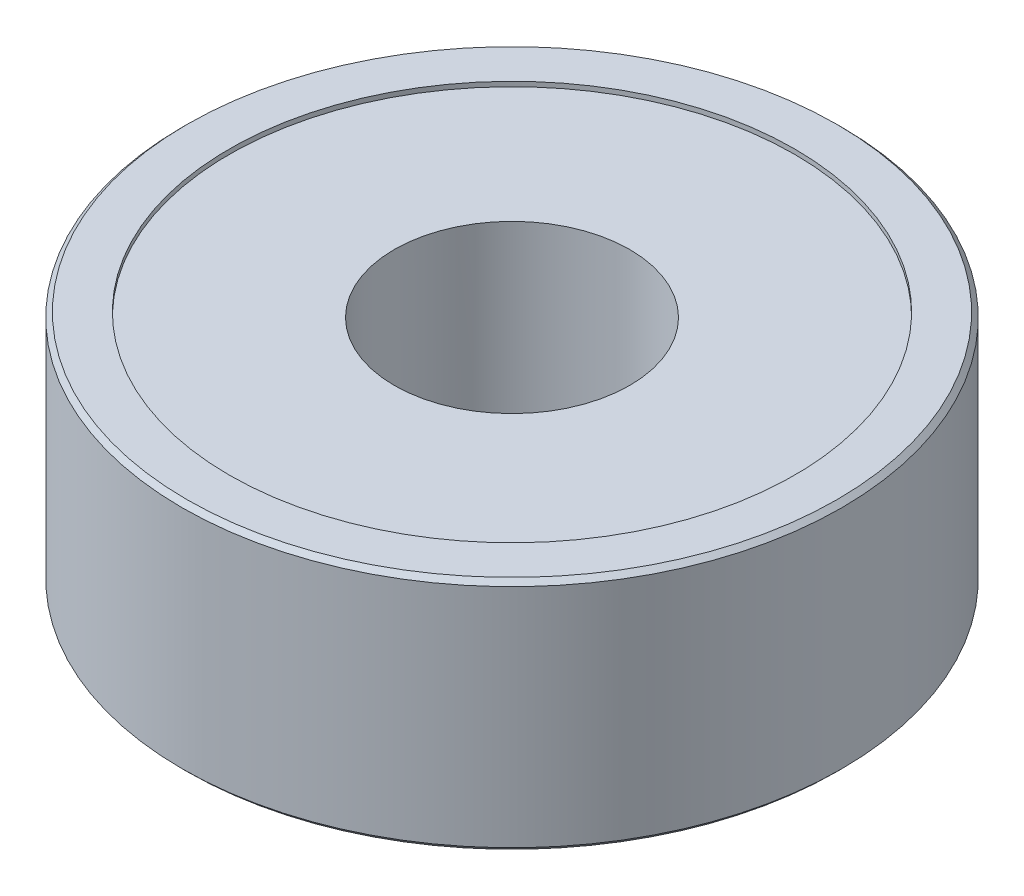
ISO-10303-21;
HEADER;
FILE_DESCRIPTION(('STEP AP214'),'2;1');
FILE_NAME('part.step','',(''),(''),'','','');
FILE_SCHEMA(('AUTOMOTIVE_DESIGN { 1 0 10303 214 1 1 1 1 }'));
ENDSEC;
DATA;
#1=APPLICATION_CONTEXT('core data for automotive mechanical design processes');
#2=APPLICATION_PROTOCOL_DEFINITION('international standard','automotive_design',2000,#1);
#3=PRODUCT_CONTEXT('',#1,'mechanical');
#4=PRODUCT('Part','Part','',(#3));
#5=PRODUCT_RELATED_PRODUCT_CATEGORY('part','',(#4));
#6=PRODUCT_DEFINITION_FORMATION('','',#4);
#7=PRODUCT_DEFINITION_CONTEXT('part definition',#1,'design');
#8=PRODUCT_DEFINITION('design','',#6,#7);
#9=PRODUCT_DEFINITION_SHAPE('','',#8);
#10=(LENGTH_UNIT() NAMED_UNIT(*) SI_UNIT(.MILLI.,.METRE.));
#11=(NAMED_UNIT(*) PLANE_ANGLE_UNIT() SI_UNIT($,.RADIAN.));
#12=(NAMED_UNIT(*) SI_UNIT($,.STERADIAN.) SOLID_ANGLE_UNIT());
#13=UNCERTAINTY_MEASURE_WITH_UNIT(LENGTH_MEASURE(1.E-05),#10,'distance_accuracy_value','');
#14=(GEOMETRIC_REPRESENTATION_CONTEXT(3) GLOBAL_UNCERTAINTY_ASSIGNED_CONTEXT((#13)) GLOBAL_UNIT_ASSIGNED_CONTEXT((#10,
#11,#12)) REPRESENTATION_CONTEXT('',''));
#15=CARTESIAN_POINT('',(0.,0.,0.));
#16=DIRECTION('',(0.,0.,1.));
#17=DIRECTION('',(1.,0.,0.));
#18=AXIS2_PLACEMENT_3D('',#15,#16,#17);
#19=CARTESIAN_POINT('',(0.,5.,0.));
#20=DIRECTION('',(0.,-1.,0.));
#21=DIRECTION('',(0.,0.,-1.));
#22=AXIS2_PLACEMENT_3D('',#19,#20,#21);
#23=CYLINDRICAL_SURFACE('',#22,2.5);
#24=CARTESIAN_POINT('',(0.,4.9,0.));
#25=DIRECTION('',(0.,1.,0.));
#26=DIRECTION('',(0.,0.,1.));
#27=AXIS2_PLACEMENT_3D('',#24,#25,#26);
#28=CIRCLE('',#27,2.5);
#29=CARTESIAN_POINT('',(0.,4.9,2.5));
#30=VERTEX_POINT('',#29);
#31=EDGE_CURVE('E64',#30,#30,#28,.T.);
#32=ORIENTED_EDGE('',*,*,#31,.T.);
#33=EDGE_LOOP('',(#32));
#34=FACE_BOUND('',#33,.T.);
#35=CARTESIAN_POINT('',(0.,0.1,0.));
#36=DIRECTION('',(0.,-1.,0.));
#37=DIRECTION('',(0.,0.,-1.));
#38=AXIS2_PLACEMENT_3D('',#35,#36,#37);
#39=CIRCLE('',#38,2.5);
#40=CARTESIAN_POINT('',(0.,0.1,-2.5));
#41=VERTEX_POINT('',#40);
#42=EDGE_CURVE('E65',#41,#41,#39,.T.);
#43=ORIENTED_EDGE('',*,*,#42,.T.);
#44=EDGE_LOOP('',(#43));
#45=FACE_BOUND('',#44,.T.);
#46=ADVANCED_FACE('F43',(#34,#45),#23,.F.);
#47=CARTESIAN_POINT('',(0.,5.,0.));
#48=DIRECTION('',(0.,1.,0.));
#49=DIRECTION('',(0.,0.,1.));
#50=AXIS2_PLACEMENT_3D('',#47,#48,#49);
#51=PLANE('',#50);
#52=CARTESIAN_POINT('',(0.,5.,0.));
#53=DIRECTION('',(0.,1.,0.));
#54=DIRECTION('',(0.,0.,1.));
#55=AXIS2_PLACEMENT_3D('',#52,#53,#54);
#56=CIRCLE('',#55,6.90000000000001);
#57=CARTESIAN_POINT('',(0.,5.,6.90000000000001));
#58=VERTEX_POINT('',#57);
#59=EDGE_CURVE('E59',#58,#58,#56,.T.);
#60=ORIENTED_EDGE('',*,*,#59,.T.);
#61=EDGE_LOOP('',(#60));
#62=FACE_BOUND('',#61,.T.);
#63=CARTESIAN_POINT('',(0.,5.,0.));
#64=DIRECTION('',(0.,1.,0.));
#65=DIRECTION('',(0.,0.,1.));
#66=AXIS2_PLACEMENT_3D('',#63,#64,#65);
#67=CIRCLE('',#66,6.);
#68=CARTESIAN_POINT('',(0.,5.,6.));
#69=VERTEX_POINT('',#68);
#70=EDGE_CURVE('E68',#69,#69,#67,.T.);
#71=ORIENTED_EDGE('',*,*,#70,.F.);
#72=EDGE_LOOP('',(#71));
#73=FACE_BOUND('',#72,.T.);
#74=ADVANCED_FACE('F95',(#62,#73),#51,.T.);
#75=CARTESIAN_POINT('',(0.,0.,0.));
#76=DIRECTION('',(0.,1.,0.));
#77=DIRECTION('',(0.,0.,1.));
#78=AXIS2_PLACEMENT_3D('',#75,#76,#77);
#79=PLANE('',#78);
#80=CARTESIAN_POINT('',(0.,0.,0.));
#81=DIRECTION('',(0.,1.,0.));
#82=DIRECTION('',(0.,0.,1.));
#83=AXIS2_PLACEMENT_3D('',#80,#81,#82);
#84=CIRCLE('',#83,6.9);
#85=CARTESIAN_POINT('',(0.,0.,6.9));
#86=VERTEX_POINT('',#85);
#87=EDGE_CURVE('E10',#86,#86,#84,.F.);
#88=ORIENTED_EDGE('',*,*,#87,.T.);
#89=EDGE_LOOP('',(#88));
#90=FACE_BOUND('',#89,.T.);
#91=CARTESIAN_POINT('',(0.,0.,0.));
#92=DIRECTION('',(0.,-1.,0.));
#93=DIRECTION('',(0.,0.,-1.));
#94=AXIS2_PLACEMENT_3D('',#91,#92,#93);
#95=CIRCLE('',#94,6.);
#96=CARTESIAN_POINT('',(0.,0.,-6.));
#97=VERTEX_POINT('',#96);
#98=EDGE_CURVE('E77',#97,#97,#95,.T.);
#99=ORIENTED_EDGE('',*,*,#98,.F.);
#100=EDGE_LOOP('',(#99));
#101=FACE_BOUND('',#100,.T.);
#102=ADVANCED_FACE('F92',(#90,#101),#79,.F.);
#103=CARTESIAN_POINT('',(0.,5.,0.));
#104=DIRECTION('',(0.,-1.,0.));
#105=DIRECTION('',(0.,0.,-1.));
#106=AXIS2_PLACEMENT_3D('',#103,#104,#105);
#107=CYLINDRICAL_SURFACE('',#106,7.);
#108=CARTESIAN_POINT('',(0.,4.9,0.));
#109=DIRECTION('',(0.,1.,0.));
#110=DIRECTION('',(0.,0.,1.));
#111=AXIS2_PLACEMENT_3D('',#108,#109,#110);
#112=CIRCLE('',#111,7.);
#113=CARTESIAN_POINT('',(0.,4.9,7.));
#114=VERTEX_POINT('',#113);
#115=EDGE_CURVE('E51',#114,#114,#112,.F.);
#116=ORIENTED_EDGE('',*,*,#115,.T.);
#117=EDGE_LOOP('',(#116));
#118=FACE_BOUND('',#117,.T.);
#119=CARTESIAN_POINT('',(0.,0.100000000000003,0.));
#120=DIRECTION('',(0.,1.,0.));
#121=DIRECTION('',(0.,0.,1.));
#122=AXIS2_PLACEMENT_3D('',#119,#120,#121);
#123=CIRCLE('',#122,7.);
#124=CARTESIAN_POINT('',(0.,0.100000000000003,7.));
#125=VERTEX_POINT('',#124);
#126=EDGE_CURVE('E55',#125,#125,#123,.T.);
#127=ORIENTED_EDGE('',*,*,#126,.T.);
#128=EDGE_LOOP('',(#127));
#129=FACE_BOUND('',#128,.T.);
#130=ADVANCED_FACE('F94',(#118,#129),#107,.T.);
#131=CARTESIAN_POINT('',(0.,4.9,0.));
#132=DIRECTION('',(0.,1.,0.));
#133=DIRECTION('',(0.,0.,1.));
#134=AXIS2_PLACEMENT_3D('',#131,#132,#133);
#135=CYLINDRICAL_SURFACE('',#134,6.);
#136=CARTESIAN_POINT('',(0.,4.9,0.));
#137=DIRECTION('',(0.,1.,0.));
#138=DIRECTION('',(0.,0.,1.));
#139=AXIS2_PLACEMENT_3D('',#136,#137,#138);
#140=CIRCLE('',#139,6.);
#141=CARTESIAN_POINT('',(0.,4.9,6.));
#142=VERTEX_POINT('',#141);
#143=EDGE_CURVE('E72',#142,#142,#140,.T.);
#144=ORIENTED_EDGE('',*,*,#143,.F.);
#145=EDGE_LOOP('',(#144));
#146=FACE_BOUND('',#145,.T.);
#147=ORIENTED_EDGE('',*,*,#70,.T.);
#148=EDGE_LOOP('',(#147));
#149=FACE_BOUND('',#148,.T.);
#150=ADVANCED_FACE('F101',(#146,#149),#135,.F.);
#151=CARTESIAN_POINT('',(0.,4.9,0.));
#152=DIRECTION('',(0.,1.,0.));
#153=DIRECTION('',(0.,0.,1.));
#154=AXIS2_PLACEMENT_3D('',#151,#152,#153);
#155=PLANE('',#154);
#156=ORIENTED_EDGE('',*,*,#31,.F.);
#157=EDGE_LOOP('',(#156));
#158=FACE_BOUND('',#157,.T.);
#159=ORIENTED_EDGE('',*,*,#143,.T.);
#160=EDGE_LOOP('',(#159));
#161=FACE_BOUND('',#160,.T.);
#162=ADVANCED_FACE('F88',(#158,#161),#155,.T.);
#163=CARTESIAN_POINT('',(0.,0.1,0.));
#164=DIRECTION('',(0.,-1.,0.));
#165=DIRECTION('',(0.,0.,-1.));
#166=AXIS2_PLACEMENT_3D('',#163,#164,#165);
#167=CYLINDRICAL_SURFACE('',#166,6.);
#168=CARTESIAN_POINT('',(0.,0.1,0.));
#169=DIRECTION('',(0.,-1.,0.));
#170=DIRECTION('',(0.,0.,-1.));
#171=AXIS2_PLACEMENT_3D('',#168,#169,#170);
#172=CIRCLE('',#171,6.);
#173=CARTESIAN_POINT('',(0.,0.1,-6.));
#174=VERTEX_POINT('',#173);
#175=EDGE_CURVE('E69',#174,#174,#172,.T.);
#176=ORIENTED_EDGE('',*,*,#175,.F.);
#177=EDGE_LOOP('',(#176));
#178=FACE_BOUND('',#177,.T.);
#179=ORIENTED_EDGE('',*,*,#98,.T.);
#180=EDGE_LOOP('',(#179));
#181=FACE_BOUND('',#180,.T.);
#182=ADVANCED_FACE('F85',(#178,#181),#167,.F.);
#183=CARTESIAN_POINT('',(0.,0.1,0.));
#184=DIRECTION('',(0.,-1.,0.));
#185=DIRECTION('',(0.,0.,-1.));
#186=AXIS2_PLACEMENT_3D('',#183,#184,#185);
#187=PLANE('',#186);
#188=ORIENTED_EDGE('',*,*,#42,.F.);
#189=EDGE_LOOP('',(#188));
#190=FACE_BOUND('',#189,.T.);
#191=ORIENTED_EDGE('',*,*,#175,.T.);
#192=EDGE_LOOP('',(#191));
#193=FACE_BOUND('',#192,.T.);
#194=ADVANCED_FACE('F83',(#190,#193),#187,.T.);
#195=CARTESIAN_POINT('',(0.,5.,0.));
#196=DIRECTION('',(0.,-1.,0.));
#197=DIRECTION('',(0.,0.,-1.));
#198=AXIS2_PLACEMENT_3D('',#195,#196,#197);
#199=CONICAL_SURFACE('',#198,6.90000000000001,0.78539816339744);
#200=ORIENTED_EDGE('',*,*,#115,.F.);
#201=EDGE_LOOP('',(#200));
#202=FACE_BOUND('',#201,.T.);
#203=ORIENTED_EDGE('',*,*,#59,.F.);
#204=EDGE_LOOP('',(#203));
#205=FACE_BOUND('',#204,.T.);
#206=ADVANCED_FACE('F119',(#202,#205),#199,.T.);
#207=CARTESIAN_POINT('',(0.,0.100000000000003,0.));
#208=DIRECTION('',(0.,1.,0.));
#209=DIRECTION('',(0.,0.,1.));
#210=AXIS2_PLACEMENT_3D('',#207,#208,#209);
#211=CONICAL_SURFACE('',#210,7.,0.785398163397448);
#212=ORIENTED_EDGE('',*,*,#87,.F.);
#213=EDGE_LOOP('',(#212));
#214=FACE_BOUND('',#213,.T.);
#215=ORIENTED_EDGE('',*,*,#126,.F.);
#216=EDGE_LOOP('',(#215));
#217=FACE_BOUND('',#216,.T.);
#218=ADVANCED_FACE('F46',(#214,#217),#211,.T.);
#219=CLOSED_SHELL('',(#46,#74,#102,#130,#150,#162,#182,#194,#206,#218));
#220=MANIFOLD_SOLID_BREP('B2',#219);
#221=ADVANCED_BREP_SHAPE_REPRESENTATION('',(#18,#220),#14);
#222=SHAPE_DEFINITION_REPRESENTATION(#9,#221);
ENDSEC;
END-ISO-10303-21;
